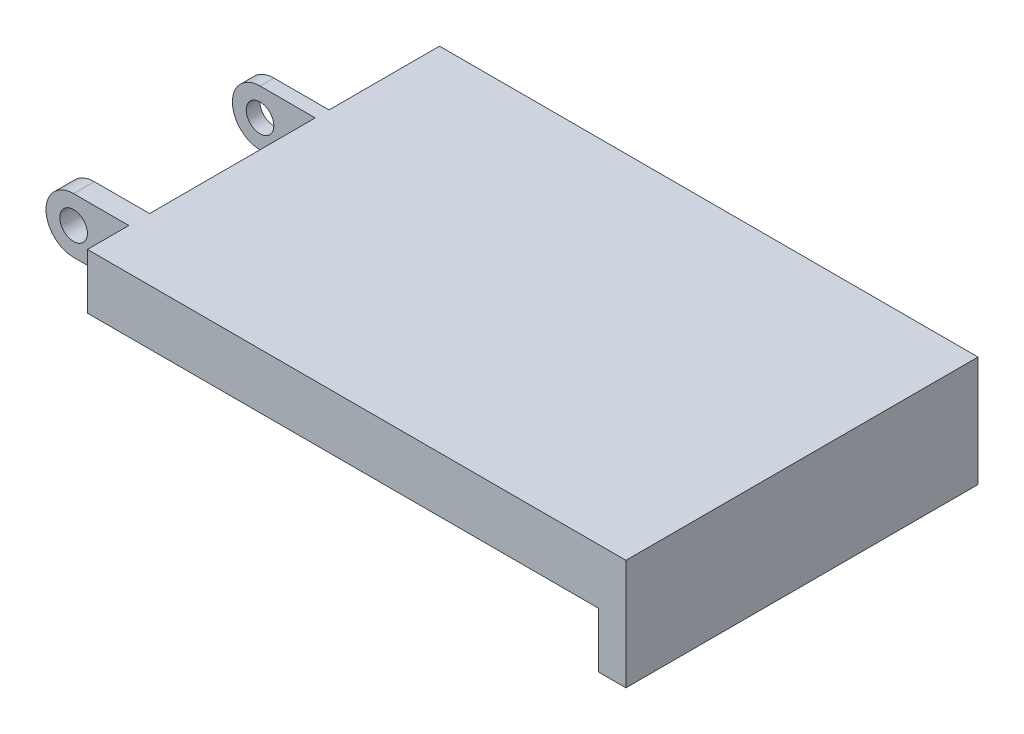
ISO-10303-21;
HEADER;
FILE_DESCRIPTION(('STEP AP214'),'2;1');
FILE_NAME('part.step','',(''),(''),'','','');
FILE_SCHEMA(('AUTOMOTIVE_DESIGN { 1 0 10303 214 1 1 1 1 }'));
ENDSEC;
DATA;
#1=APPLICATION_CONTEXT('core data for automotive mechanical design processes');
#2=APPLICATION_PROTOCOL_DEFINITION('international standard','automotive_design',2000,#1);
#3=PRODUCT_CONTEXT('',#1,'mechanical');
#4=PRODUCT('Part','Part','',(#3));
#5=PRODUCT_RELATED_PRODUCT_CATEGORY('part','',(#4));
#6=PRODUCT_DEFINITION_FORMATION('','',#4);
#7=PRODUCT_DEFINITION_CONTEXT('part definition',#1,'design');
#8=PRODUCT_DEFINITION('design','',#6,#7);
#9=PRODUCT_DEFINITION_SHAPE('','',#8);
#10=(LENGTH_UNIT() NAMED_UNIT(*) SI_UNIT(.MILLI.,.METRE.));
#11=(NAMED_UNIT(*) PLANE_ANGLE_UNIT() SI_UNIT($,.RADIAN.));
#12=(NAMED_UNIT(*) SI_UNIT($,.STERADIAN.) SOLID_ANGLE_UNIT());
#13=UNCERTAINTY_MEASURE_WITH_UNIT(LENGTH_MEASURE(1.E-05),#10,'distance_accuracy_value','');
#14=(GEOMETRIC_REPRESENTATION_CONTEXT(3) GLOBAL_UNCERTAINTY_ASSIGNED_CONTEXT((#13)) GLOBAL_UNIT_ASSIGNED_CONTEXT((#10,
#11,#12)) REPRESENTATION_CONTEXT('',''));
#15=CARTESIAN_POINT('',(0.,0.,0.));
#16=DIRECTION('',(0.,0.,1.));
#17=DIRECTION('',(1.,0.,0.));
#18=AXIS2_PLACEMENT_3D('',#15,#16,#17);
#19=CARTESIAN_POINT('',(41.,-5.99999999999999,25.5));
#20=DIRECTION('',(1.,0.,0.));
#21=DIRECTION('',(0.,0.,-1.));
#22=AXIS2_PLACEMENT_3D('',#19,#20,#21);
#23=PLANE('',#22);
#24=DIRECTION('',(0.,1.,0.));
#25=VECTOR('',#24,1.);
#26=CARTESIAN_POINT('',(41.,-6.,13.75));
#27=LINE('',#26,#25);
#28=CARTESIAN_POINT('',(41.,-6.,13.75));
#29=VERTEX_POINT('',#28);
#30=CARTESIAN_POINT('',(41.,-5.06840956055413,13.75));
#31=VERTEX_POINT('',#30);
#32=EDGE_CURVE('E189',#29,#31,#27,.T.);
#33=ORIENTED_EDGE('',*,*,#32,.F.);
#34=DIRECTION('',(0.,0.,-1.));
#35=VECTOR('',#34,1.);
#36=CARTESIAN_POINT('',(41.,-5.99999999999999,25.5));
#37=LINE('',#36,#35);
#38=CARTESIAN_POINT('',(41.,-5.99999999999999,25.5));
#39=VERTEX_POINT('',#38);
#40=EDGE_CURVE('E175',#39,#29,#37,.T.);
#41=ORIENTED_EDGE('',*,*,#40,.F.);
#42=DIRECTION('',(0.,-1.,0.));
#43=VECTOR('',#42,1.);
#44=CARTESIAN_POINT('',(41.,-5.99999999999999,25.5));
#45=LINE('',#44,#43);
#46=CARTESIAN_POINT('',(41.,-2.,25.5));
#47=VERTEX_POINT('',#46);
#48=EDGE_CURVE('E269',#47,#39,#45,.T.);
#49=ORIENTED_EDGE('',*,*,#48,.F.);
#50=DIRECTION('',(0.,0.,-1.));
#51=VECTOR('',#50,1.);
#52=CARTESIAN_POINT('',(41.,-2.,25.5));
#53=LINE('',#52,#51);
#54=CARTESIAN_POINT('',(41.,-2.,0.));
#55=VERTEX_POINT('',#54);
#56=EDGE_CURVE('E301',#47,#55,#53,.T.);
#57=ORIENTED_EDGE('',*,*,#56,.T.);
#58=DIRECTION('',(0.,-1.,0.));
#59=VECTOR('',#58,1.);
#60=CARTESIAN_POINT('',(41.,-5.99999999999999,0.));
#61=LINE('',#60,#59);
#62=CARTESIAN_POINT('',(41.,-5.99999999999999,0.));
#63=VERTEX_POINT('',#62);
#64=EDGE_CURVE('E281',#55,#63,#61,.T.);
#65=ORIENTED_EDGE('',*,*,#64,.T.);
#66=CARTESIAN_POINT('',(41.,-5.99999999999999,11.75));
#67=VERTEX_POINT('',#66);
#68=EDGE_CURVE('E299',#67,#63,#37,.T.);
#69=ORIENTED_EDGE('',*,*,#68,.F.);
#70=DIRECTION('',(0.,-1.,0.));
#71=VECTOR('',#70,1.);
#72=CARTESIAN_POINT('',(41.,-5.06840956055413,11.75));
#73=LINE('',#72,#71);
#74=CARTESIAN_POINT('',(41.,-5.06840956055413,11.75));
#75=VERTEX_POINT('',#74);
#76=EDGE_CURVE('E168',#75,#67,#73,.T.);
#77=ORIENTED_EDGE('',*,*,#76,.F.);
#78=DIRECTION('',(0.,0.,-1.));
#79=VECTOR('',#78,1.);
#80=CARTESIAN_POINT('',(41.,-5.06840956055413,13.75));
#81=LINE('',#80,#79);
#82=EDGE_CURVE('E191',#31,#75,#81,.T.);
#83=ORIENTED_EDGE('',*,*,#82,.F.);
#84=EDGE_LOOP('',(#33,#41,#49,#57,#65,#69,#77,#83));
#85=FACE_BOUND('',#84,.T.);
#86=ADVANCED_FACE('F35',(#85),#23,.F.);
#87=CARTESIAN_POINT('',(0.,0.,25.5));
#88=DIRECTION('',(0.,0.,-1.));
#89=DIRECTION('',(-1.,0.,0.));
#90=AXIS2_PLACEMENT_3D('',#87,#88,#89);
#91=CYLINDRICAL_SURFACE('',#90,2.);
#92=CARTESIAN_POINT('',(0.,0.,21.));
#93=DIRECTION('',(0.,0.,-1.));
#94=DIRECTION('',(-1.,0.,0.));
#95=AXIS2_PLACEMENT_3D('',#92,#93,#94);
#96=CIRCLE('',#95,2.);
#97=CARTESIAN_POINT('',(0.,-2.,21.));
#98=VERTEX_POINT('',#97);
#99=CARTESIAN_POINT('',(0.,2.,21.));
#100=VERTEX_POINT('',#99);
#101=EDGE_CURVE('E199',#98,#100,#96,.T.);
#102=ORIENTED_EDGE('',*,*,#101,.F.);
#103=DIRECTION('',(0.,0.,-1.));
#104=VECTOR('',#103,1.);
#105=CARTESIAN_POINT('',(0.,-2.,25.5));
#106=LINE('',#105,#104);
#107=CARTESIAN_POINT('',(0.,-2.,22.5));
#108=VERTEX_POINT('',#107);
#109=EDGE_CURVE('E11',#108,#98,#106,.T.);
#110=ORIENTED_EDGE('',*,*,#109,.F.);
#111=CARTESIAN_POINT('',(0.,0.,22.5));
#112=DIRECTION('',(0.,0.,1.));
#113=DIRECTION('',(1.,0.,0.));
#114=AXIS2_PLACEMENT_3D('',#111,#112,#113);
#115=CIRCLE('',#114,2.);
#116=CARTESIAN_POINT('',(0.,2.,22.5));
#117=VERTEX_POINT('',#116);
#118=EDGE_CURVE('E264',#117,#108,#115,.T.);
#119=ORIENTED_EDGE('',*,*,#118,.F.);
#120=DIRECTION('',(0.,0.,-1.));
#121=VECTOR('',#120,1.);
#122=CARTESIAN_POINT('',(0.,2.,25.5));
#123=LINE('',#122,#121);
#124=EDGE_CURVE('E290',#117,#100,#123,.T.);
#125=ORIENTED_EDGE('',*,*,#124,.T.);
#126=EDGE_LOOP('',(#102,#110,#119,#125));
#127=FACE_BOUND('',#126,.T.);
#128=ADVANCED_FACE('F352',(#127),#91,.T.);
#129=CARTESIAN_POINT('',(0.,0.,25.5));
#130=DIRECTION('',(0.,0.,-1.));
#131=DIRECTION('',(-1.,0.,0.));
#132=AXIS2_PLACEMENT_3D('',#129,#130,#131);
#133=CYLINDRICAL_SURFACE('',#132,1.);
#134=CARTESIAN_POINT('',(0.,0.,22.5));
#135=DIRECTION('',(0.,0.,1.));
#136=DIRECTION('',(1.,0.,0.));
#137=AXIS2_PLACEMENT_3D('',#134,#135,#136);
#138=CIRCLE('',#137,1.);
#139=CARTESIAN_POINT('',(1.,0.,22.5));
#140=VERTEX_POINT('',#139);
#141=EDGE_CURVE('E39',#140,#140,#138,.T.);
#142=ORIENTED_EDGE('',*,*,#141,.T.);
#143=EDGE_LOOP('',(#142));
#144=FACE_BOUND('',#143,.T.);
#145=CARTESIAN_POINT('',(0.,0.,21.));
#146=DIRECTION('',(0.,0.,-1.));
#147=DIRECTION('',(-1.,0.,0.));
#148=AXIS2_PLACEMENT_3D('',#145,#146,#147);
#149=CIRCLE('',#148,1.);
#150=CARTESIAN_POINT('',(-1.,0.,21.));
#151=VERTEX_POINT('',#150);
#152=EDGE_CURVE('E226',#151,#151,#149,.T.);
#153=ORIENTED_EDGE('',*,*,#152,.T.);
#154=EDGE_LOOP('',(#153));
#155=FACE_BOUND('',#154,.T.);
#156=ADVANCED_FACE('F375',(#144,#155),#133,.F.);
#157=CARTESIAN_POINT('',(41.,-2.,25.5));
#158=DIRECTION('',(0.,1.,0.));
#159=DIRECTION('',(-1.,0.,0.));
#160=AXIS2_PLACEMENT_3D('',#157,#158,#159);
#161=PLANE('',#160);
#162=DIRECTION('',(-1.,0.,0.));
#163=VECTOR('',#162,1.);
#164=CARTESIAN_POINT('',(4.,-2.,21.));
#165=LINE('',#164,#163);
#166=CARTESIAN_POINT('',(4.,-2.,21.));
#167=VERTEX_POINT('',#166);
#168=EDGE_CURVE('E208',#167,#98,#165,.T.);
#169=ORIENTED_EDGE('',*,*,#168,.F.);
#170=DIRECTION('',(0.,0.,-1.));
#171=VECTOR('',#170,1.);
#172=CARTESIAN_POINT('',(4.,-2.,21.));
#173=LINE('',#172,#171);
#174=CARTESIAN_POINT('',(4.,-2.,9.));
#175=VERTEX_POINT('',#174);
#176=EDGE_CURVE('E219',#167,#175,#173,.T.);
#177=ORIENTED_EDGE('',*,*,#176,.T.);
#178=DIRECTION('',(-1.,0.,0.));
#179=VECTOR('',#178,1.);
#180=CARTESIAN_POINT('',(4.,-2.,9.));
#181=LINE('',#180,#179);
#182=CARTESIAN_POINT('',(0.,-2.,9.));
#183=VERTEX_POINT('',#182);
#184=EDGE_CURVE('E202',#175,#183,#181,.T.);
#185=ORIENTED_EDGE('',*,*,#184,.T.);
#186=CARTESIAN_POINT('',(0.,-2.,8.));
#187=VERTEX_POINT('',#186);
#188=EDGE_CURVE('E44',#183,#187,#106,.T.);
#189=ORIENTED_EDGE('',*,*,#188,.T.);
#190=DIRECTION('',(-1.,0.,0.));
#191=VECTOR('',#190,1.);
#192=CARTESIAN_POINT('',(4.,-2.,8.));
#193=LINE('',#192,#191);
#194=CARTESIAN_POINT('',(4.,-2.,8.));
#195=VERTEX_POINT('',#194);
#196=EDGE_CURVE('E239',#195,#187,#193,.T.);
#197=ORIENTED_EDGE('',*,*,#196,.F.);
#198=DIRECTION('',(0.,0.,-1.));
#199=VECTOR('',#198,1.);
#200=CARTESIAN_POINT('',(4.,-2.,8.));
#201=LINE('',#200,#199);
#202=CARTESIAN_POINT('',(4.,-2.,0.));
#203=VERTEX_POINT('',#202);
#204=EDGE_CURVE('E244',#195,#203,#201,.T.);
#205=ORIENTED_EDGE('',*,*,#204,.T.);
#206=DIRECTION('',(1.,0.,0.));
#207=VECTOR('',#206,1.);
#208=CARTESIAN_POINT('',(41.,-2.,0.));
#209=LINE('',#208,#207);
#210=EDGE_CURVE('E266',#203,#55,#209,.T.);
#211=ORIENTED_EDGE('',*,*,#210,.T.);
#212=ORIENTED_EDGE('',*,*,#56,.F.);
#213=DIRECTION('',(1.,0.,0.));
#214=VECTOR('',#213,1.);
#215=CARTESIAN_POINT('',(41.,-2.,25.5));
#216=LINE('',#215,#214);
#217=CARTESIAN_POINT('',(4.,-2.,25.5));
#218=VERTEX_POINT('',#217);
#219=EDGE_CURVE('E267',#218,#47,#216,.T.);
#220=ORIENTED_EDGE('',*,*,#219,.F.);
#221=DIRECTION('',(0.,0.,1.));
#222=VECTOR('',#221,1.);
#223=CARTESIAN_POINT('',(4.,-2.,22.5));
#224=LINE('',#223,#222);
#225=CARTESIAN_POINT('',(4.,-2.,22.5));
#226=VERTEX_POINT('',#225);
#227=EDGE_CURVE('E258',#226,#218,#224,.T.);
#228=ORIENTED_EDGE('',*,*,#227,.F.);
#229=DIRECTION('',(1.,0.,0.));
#230=VECTOR('',#229,1.);
#231=CARTESIAN_POINT('',(-4.,-2.,22.5));
#232=LINE('',#231,#230);
#233=EDGE_CURVE('E252',#108,#226,#232,.T.);
#234=ORIENTED_EDGE('',*,*,#233,.F.);
#235=ORIENTED_EDGE('',*,*,#109,.T.);
#236=EDGE_LOOP('',(#169,#177,#185,#189,#197,#205,#211,#212,#220,#228,#234,#235));
#237=FACE_BOUND('',#236,.T.);
#238=ADVANCED_FACE('F311',(#237),#161,.F.);
#239=CARTESIAN_POINT('',(0.,2.,25.5));
#240=DIRECTION('',(0.,-1.,0.));
#241=DIRECTION('',(1.,0.,0.));
#242=AXIS2_PLACEMENT_3D('',#239,#240,#241);
#243=PLANE('',#242);
#244=DIRECTION('',(1.,0.,0.));
#245=VECTOR('',#244,1.);
#246=CARTESIAN_POINT('',(0.,2.,21.));
#247=LINE('',#246,#245);
#248=CARTESIAN_POINT('',(4.,2.,21.));
#249=VERTEX_POINT('',#248);
#250=EDGE_CURVE('E201',#100,#249,#247,.T.);
#251=ORIENTED_EDGE('',*,*,#250,.F.);
#252=ORIENTED_EDGE('',*,*,#124,.F.);
#253=DIRECTION('',(-1.,0.,0.));
#254=VECTOR('',#253,1.);
#255=CARTESIAN_POINT('',(4.,2.,22.5));
#256=LINE('',#255,#254);
#257=CARTESIAN_POINT('',(4.,2.,22.5));
#258=VERTEX_POINT('',#257);
#259=EDGE_CURVE('E256',#258,#117,#256,.T.);
#260=ORIENTED_EDGE('',*,*,#259,.F.);
#261=DIRECTION('',(0.,0.,1.));
#262=VECTOR('',#261,1.);
#263=CARTESIAN_POINT('',(4.,2.,22.5));
#264=LINE('',#263,#262);
#265=CARTESIAN_POINT('',(4.,2.,25.5));
#266=VERTEX_POINT('',#265);
#267=EDGE_CURVE('E260',#258,#266,#264,.T.);
#268=ORIENTED_EDGE('',*,*,#267,.T.);
#269=DIRECTION('',(-1.,0.,0.));
#270=VECTOR('',#269,1.);
#271=CARTESIAN_POINT('',(0.,2.,25.5));
#272=LINE('',#271,#270);
#273=CARTESIAN_POINT('',(43.,1.99999999999999,25.5));
#274=VERTEX_POINT('',#273);
#275=EDGE_CURVE('E276',#274,#266,#272,.T.);
#276=ORIENTED_EDGE('',*,*,#275,.F.);
#277=DIRECTION('',(0.,0.,-1.));
#278=VECTOR('',#277,1.);
#279=CARTESIAN_POINT('',(43.,1.99999999999999,25.5));
#280=LINE('',#279,#278);
#281=CARTESIAN_POINT('',(43.,1.99999999999999,0.));
#282=VERTEX_POINT('',#281);
#283=EDGE_CURVE('E293',#274,#282,#280,.T.);
#284=ORIENTED_EDGE('',*,*,#283,.T.);
#285=DIRECTION('',(-1.,0.,0.));
#286=VECTOR('',#285,1.);
#287=CARTESIAN_POINT('',(0.,2.,0.));
#288=LINE('',#287,#286);
#289=CARTESIAN_POINT('',(4.,2.,0.));
#290=VERTEX_POINT('',#289);
#291=EDGE_CURVE('E270',#282,#290,#288,.T.);
#292=ORIENTED_EDGE('',*,*,#291,.T.);
#293=DIRECTION('',(0.,0.,-1.));
#294=VECTOR('',#293,1.);
#295=CARTESIAN_POINT('',(4.,2.,8.));
#296=LINE('',#295,#294);
#297=CARTESIAN_POINT('',(4.,2.,8.));
#298=VERTEX_POINT('',#297);
#299=EDGE_CURVE('E242',#298,#290,#296,.T.);
#300=ORIENTED_EDGE('',*,*,#299,.F.);
#301=DIRECTION('',(1.,0.,0.));
#302=VECTOR('',#301,1.);
#303=CARTESIAN_POINT('',(0.,2.,8.));
#304=LINE('',#303,#302);
#305=CARTESIAN_POINT('',(0.,2.,8.));
#306=VERTEX_POINT('',#305);
#307=EDGE_CURVE('E233',#306,#298,#304,.T.);
#308=ORIENTED_EDGE('',*,*,#307,.F.);
#309=CARTESIAN_POINT('',(0.,2.,9.));
#310=VERTEX_POINT('',#309);
#311=EDGE_CURVE('E279',#310,#306,#123,.T.);
#312=ORIENTED_EDGE('',*,*,#311,.F.);
#313=DIRECTION('',(1.,0.,0.));
#314=VECTOR('',#313,1.);
#315=CARTESIAN_POINT('',(0.,2.,9.));
#316=LINE('',#315,#314);
#317=CARTESIAN_POINT('',(4.,2.,9.));
#318=VERTEX_POINT('',#317);
#319=EDGE_CURVE('E213',#310,#318,#316,.T.);
#320=ORIENTED_EDGE('',*,*,#319,.T.);
#321=DIRECTION('',(0.,0.,-1.));
#322=VECTOR('',#321,1.);
#323=CARTESIAN_POINT('',(4.,2.,21.));
#324=LINE('',#323,#322);
#325=EDGE_CURVE('E210',#249,#318,#324,.T.);
#326=ORIENTED_EDGE('',*,*,#325,.F.);
#327=EDGE_LOOP('',(#251,#252,#260,#268,#276,#284,#292,#300,#308,#312,#320,#326));
#328=FACE_BOUND('',#327,.T.);
#329=ADVANCED_FACE('F320',(#328),#243,.F.);
#330=ORIENTED_EDGE('',*,*,#188,.F.);
#331=CARTESIAN_POINT('',(0.,0.,9.));
#332=DIRECTION('',(0.,0.,-1.));
#333=DIRECTION('',(-1.,0.,0.));
#334=AXIS2_PLACEMENT_3D('',#331,#332,#333);
#335=CIRCLE('',#334,2.);
#336=EDGE_CURVE('E178',#183,#310,#335,.T.);
#337=ORIENTED_EDGE('',*,*,#336,.T.);
#338=ORIENTED_EDGE('',*,*,#311,.T.);
#339=CARTESIAN_POINT('',(0.,0.,8.));
#340=DIRECTION('',(0.,0.,-1.));
#341=DIRECTION('',(-1.,0.,0.));
#342=AXIS2_PLACEMENT_3D('',#339,#340,#341);
#343=CIRCLE('',#342,2.);
#344=EDGE_CURVE('E230',#187,#306,#343,.T.);
#345=ORIENTED_EDGE('',*,*,#344,.F.);
#346=EDGE_LOOP('',(#330,#337,#338,#345));
#347=FACE_BOUND('',#346,.T.);
#348=ADVANCED_FACE('F37',(#347),#91,.T.);
#349=CARTESIAN_POINT('',(0.,0.,9.));
#350=DIRECTION('',(0.,0.,-1.));
#351=DIRECTION('',(-1.,0.,0.));
#352=AXIS2_PLACEMENT_3D('',#349,#350,#351);
#353=CIRCLE('',#352,1.);
#354=CARTESIAN_POINT('',(-1.,0.,9.));
#355=VERTEX_POINT('',#354);
#356=EDGE_CURVE('E222',#355,#355,#353,.T.);
#357=ORIENTED_EDGE('',*,*,#356,.F.);
#358=EDGE_LOOP('',(#357));
#359=FACE_BOUND('',#358,.T.);
#360=CARTESIAN_POINT('',(0.,0.,8.));
#361=DIRECTION('',(0.,0.,-1.));
#362=DIRECTION('',(-1.,0.,0.));
#363=AXIS2_PLACEMENT_3D('',#360,#361,#362);
#364=CIRCLE('',#363,1.);
#365=CARTESIAN_POINT('',(-1.,0.,8.));
#366=VERTEX_POINT('',#365);
#367=EDGE_CURVE('E247',#366,#366,#364,.T.);
#368=ORIENTED_EDGE('',*,*,#367,.T.);
#369=EDGE_LOOP('',(#368));
#370=FACE_BOUND('',#369,.T.);
#371=ADVANCED_FACE('F386',(#359,#370),#133,.F.);
#372=CARTESIAN_POINT('',(0.,0.,25.5));
#373=DIRECTION('',(0.,0.,1.));
#374=DIRECTION('',(1.,0.,0.));
#375=AXIS2_PLACEMENT_3D('',#372,#373,#374);
#376=PLANE('',#375);
#377=DIRECTION('',(0.,1.,0.));
#378=VECTOR('',#377,1.);
#379=CARTESIAN_POINT('',(4.,-2.,25.5));
#380=LINE('',#379,#378);
#381=EDGE_CURVE('E251',#218,#266,#380,.T.);
#382=ORIENTED_EDGE('',*,*,#381,.F.);
#383=ORIENTED_EDGE('',*,*,#219,.T.);
#384=ORIENTED_EDGE('',*,*,#48,.T.);
#385=DIRECTION('',(1.,0.,0.));
#386=VECTOR('',#385,1.);
#387=CARTESIAN_POINT('',(43.,-5.99999999999999,25.5));
#388=LINE('',#387,#386);
#389=CARTESIAN_POINT('',(43.,-5.99999999999999,25.5));
#390=VERTEX_POINT('',#389);
#391=EDGE_CURVE('E272',#39,#390,#388,.T.);
#392=ORIENTED_EDGE('',*,*,#391,.T.);
#393=DIRECTION('',(0.,1.,0.));
#394=VECTOR('',#393,1.);
#395=CARTESIAN_POINT('',(43.,1.99999999999999,25.5));
#396=LINE('',#395,#394);
#397=EDGE_CURVE('E274',#390,#274,#396,.T.);
#398=ORIENTED_EDGE('',*,*,#397,.T.);
#399=ORIENTED_EDGE('',*,*,#275,.T.);
#400=EDGE_LOOP('',(#382,#383,#384,#392,#398,#399));
#401=FACE_BOUND('',#400,.T.);
#402=ADVANCED_FACE('F336',(#401),#376,.T.);
#403=CARTESIAN_POINT('',(0.,0.,0.));
#404=DIRECTION('',(0.,0.,1.));
#405=DIRECTION('',(1.,0.,0.));
#406=AXIS2_PLACEMENT_3D('',#403,#404,#405);
#407=PLANE('',#406);
#408=ORIENTED_EDGE('',*,*,#210,.F.);
#409=DIRECTION('',(0.,-1.,0.));
#410=VECTOR('',#409,1.);
#411=CARTESIAN_POINT('',(4.,2.,0.));
#412=LINE('',#411,#410);
#413=EDGE_CURVE('E229',#290,#203,#412,.T.);
#414=ORIENTED_EDGE('',*,*,#413,.F.);
#415=ORIENTED_EDGE('',*,*,#291,.F.);
#416=DIRECTION('',(0.,1.,0.));
#417=VECTOR('',#416,1.);
#418=CARTESIAN_POINT('',(43.,1.99999999999999,0.));
#419=LINE('',#418,#417);
#420=CARTESIAN_POINT('',(43.,-5.99999999999999,0.));
#421=VERTEX_POINT('',#420);
#422=EDGE_CURVE('E286',#421,#282,#419,.T.);
#423=ORIENTED_EDGE('',*,*,#422,.F.);
#424=DIRECTION('',(1.,0.,0.));
#425=VECTOR('',#424,1.);
#426=CARTESIAN_POINT('',(43.,-5.99999999999999,0.));
#427=LINE('',#426,#425);
#428=EDGE_CURVE('E284',#63,#421,#427,.T.);
#429=ORIENTED_EDGE('',*,*,#428,.F.);
#430=ORIENTED_EDGE('',*,*,#64,.F.);
#431=EDGE_LOOP('',(#408,#414,#415,#423,#429,#430));
#432=FACE_BOUND('',#431,.T.);
#433=ADVANCED_FACE('F329',(#432),#407,.F.);
#434=CARTESIAN_POINT('',(43.,-5.99999999999999,25.5));
#435=DIRECTION('',(0.,1.,0.));
#436=DIRECTION('',(0.,0.,1.));
#437=AXIS2_PLACEMENT_3D('',#434,#435,#436);
#438=PLANE('',#437);
#439=ORIENTED_EDGE('',*,*,#428,.T.);
#440=DIRECTION('',(0.,0.,-1.));
#441=VECTOR('',#440,1.);
#442=CARTESIAN_POINT('',(43.,-5.99999999999999,25.5));
#443=LINE('',#442,#441);
#444=EDGE_CURVE('E296',#390,#421,#443,.T.);
#445=ORIENTED_EDGE('',*,*,#444,.F.);
#446=ORIENTED_EDGE('',*,*,#391,.F.);
#447=ORIENTED_EDGE('',*,*,#40,.T.);
#448=DIRECTION('',(1.,0.,0.));
#449=VECTOR('',#448,1.);
#450=CARTESIAN_POINT('',(40.5,-6.,13.75));
#451=LINE('',#450,#449);
#452=CARTESIAN_POINT('',(40.5,-6.,13.75));
#453=VERTEX_POINT('',#452);
#454=EDGE_CURVE('E171',#453,#29,#451,.T.);
#455=ORIENTED_EDGE('',*,*,#454,.F.);
#456=DIRECTION('',(0.,0.,1.));
#457=VECTOR('',#456,1.);
#458=CARTESIAN_POINT('',(40.5,-5.99999999999999,11.75));
#459=LINE('',#458,#457);
#460=CARTESIAN_POINT('',(40.5,-5.99999999999999,11.75));
#461=VERTEX_POINT('',#460);
#462=EDGE_CURVE('E160',#461,#453,#459,.T.);
#463=ORIENTED_EDGE('',*,*,#462,.F.);
#464=DIRECTION('',(1.,0.,0.));
#465=VECTOR('',#464,1.);
#466=CARTESIAN_POINT('',(40.5,-5.99999999999999,11.75));
#467=LINE('',#466,#465);
#468=EDGE_CURVE('E51',#461,#67,#467,.T.);
#469=ORIENTED_EDGE('',*,*,#468,.T.);
#470=ORIENTED_EDGE('',*,*,#68,.T.);
#471=EDGE_LOOP('',(#439,#445,#446,#447,#455,#463,#469,#470));
#472=FACE_BOUND('',#471,.T.);
#473=ADVANCED_FACE('F172',(#472),#438,.F.);
#474=CARTESIAN_POINT('',(43.,1.99999999999999,25.5));
#475=DIRECTION('',(-1.,0.,0.));
#476=DIRECTION('',(0.,0.,1.));
#477=AXIS2_PLACEMENT_3D('',#474,#475,#476);
#478=PLANE('',#477);
#479=ORIENTED_EDGE('',*,*,#422,.T.);
#480=ORIENTED_EDGE('',*,*,#283,.F.);
#481=ORIENTED_EDGE('',*,*,#397,.F.);
#482=ORIENTED_EDGE('',*,*,#444,.T.);
#483=EDGE_LOOP('',(#479,#480,#481,#482));
#484=FACE_BOUND('',#483,.T.);
#485=ADVANCED_FACE('F412',(#484),#478,.F.);
#486=CARTESIAN_POINT('',(0.,0.,22.5));
#487=DIRECTION('',(0.,0.,1.));
#488=DIRECTION('',(1.,0.,0.));
#489=AXIS2_PLACEMENT_3D('',#486,#487,#488);
#490=PLANE('',#489);
#491=ORIENTED_EDGE('',*,*,#141,.F.);
#492=EDGE_LOOP('',(#491));
#493=FACE_BOUND('',#492,.T.);
#494=ORIENTED_EDGE('',*,*,#118,.T.);
#495=ORIENTED_EDGE('',*,*,#233,.T.);
#496=DIRECTION('',(0.,1.,0.));
#497=VECTOR('',#496,1.);
#498=CARTESIAN_POINT('',(4.,-2.,22.5));
#499=LINE('',#498,#497);
#500=EDGE_CURVE('E254',#226,#258,#499,.T.);
#501=ORIENTED_EDGE('',*,*,#500,.T.);
#502=ORIENTED_EDGE('',*,*,#259,.T.);
#503=EDGE_LOOP('',(#494,#495,#501,#502));
#504=FACE_BOUND('',#503,.T.);
#505=ADVANCED_FACE('F347',(#493,#504),#490,.T.);
#506=CARTESIAN_POINT('',(4.,-2.,22.5));
#507=DIRECTION('',(1.,0.,0.));
#508=DIRECTION('',(0.,1.,0.));
#509=AXIS2_PLACEMENT_3D('',#506,#507,#508);
#510=PLANE('',#509);
#511=ORIENTED_EDGE('',*,*,#381,.T.);
#512=ORIENTED_EDGE('',*,*,#267,.F.);
#513=ORIENTED_EDGE('',*,*,#500,.F.);
#514=ORIENTED_EDGE('',*,*,#227,.T.);
#515=EDGE_LOOP('',(#511,#512,#513,#514));
#516=FACE_BOUND('',#515,.T.);
#517=ADVANCED_FACE('F341',(#516),#510,.F.);
#518=CARTESIAN_POINT('',(4.,2.,8.));
#519=DIRECTION('',(1.,0.,0.));
#520=DIRECTION('',(0.,1.,0.));
#521=AXIS2_PLACEMENT_3D('',#518,#519,#520);
#522=PLANE('',#521);
#523=ORIENTED_EDGE('',*,*,#413,.T.);
#524=ORIENTED_EDGE('',*,*,#204,.F.);
#525=DIRECTION('',(0.,-1.,0.));
#526=VECTOR('',#525,1.);
#527=CARTESIAN_POINT('',(4.,2.,8.));
#528=LINE('',#527,#526);
#529=EDGE_CURVE('E236',#298,#195,#528,.T.);
#530=ORIENTED_EDGE('',*,*,#529,.F.);
#531=ORIENTED_EDGE('',*,*,#299,.T.);
#532=EDGE_LOOP('',(#523,#524,#530,#531));
#533=FACE_BOUND('',#532,.T.);
#534=ADVANCED_FACE('F326',(#533),#522,.F.);
#535=CARTESIAN_POINT('',(0.,0.,8.));
#536=DIRECTION('',(0.,0.,-1.));
#537=DIRECTION('',(-1.,0.,0.));
#538=AXIS2_PLACEMENT_3D('',#535,#536,#537);
#539=PLANE('',#538);
#540=ORIENTED_EDGE('',*,*,#367,.F.);
#541=EDGE_LOOP('',(#540));
#542=FACE_BOUND('',#541,.T.);
#543=ORIENTED_EDGE('',*,*,#344,.T.);
#544=ORIENTED_EDGE('',*,*,#307,.T.);
#545=ORIENTED_EDGE('',*,*,#529,.T.);
#546=ORIENTED_EDGE('',*,*,#196,.T.);
#547=EDGE_LOOP('',(#543,#544,#545,#546));
#548=FACE_BOUND('',#547,.T.);
#549=ADVANCED_FACE('F315',(#542,#548),#539,.T.);
#550=CARTESIAN_POINT('',(4.,2.,21.));
#551=DIRECTION('',(1.,0.,0.));
#552=DIRECTION('',(0.,1.,0.));
#553=AXIS2_PLACEMENT_3D('',#550,#551,#552);
#554=PLANE('',#553);
#555=DIRECTION('',(0.,-1.,0.));
#556=VECTOR('',#555,1.);
#557=CARTESIAN_POINT('',(4.,2.,9.));
#558=LINE('',#557,#556);
#559=EDGE_CURVE('E59',#318,#175,#558,.T.);
#560=ORIENTED_EDGE('',*,*,#559,.T.);
#561=ORIENTED_EDGE('',*,*,#176,.F.);
#562=DIRECTION('',(0.,-1.,0.));
#563=VECTOR('',#562,1.);
#564=CARTESIAN_POINT('',(4.,2.,21.));
#565=LINE('',#564,#563);
#566=EDGE_CURVE('E205',#249,#167,#565,.T.);
#567=ORIENTED_EDGE('',*,*,#566,.F.);
#568=ORIENTED_EDGE('',*,*,#325,.T.);
#569=EDGE_LOOP('',(#560,#561,#567,#568));
#570=FACE_BOUND('',#569,.T.);
#571=ADVANCED_FACE('F356',(#570),#554,.F.);
#572=CARTESIAN_POINT('',(0.,0.,21.));
#573=DIRECTION('',(0.,0.,-1.));
#574=DIRECTION('',(-1.,0.,0.));
#575=AXIS2_PLACEMENT_3D('',#572,#573,#574);
#576=PLANE('',#575);
#577=ORIENTED_EDGE('',*,*,#152,.F.);
#578=EDGE_LOOP('',(#577));
#579=FACE_BOUND('',#578,.T.);
#580=ORIENTED_EDGE('',*,*,#101,.T.);
#581=ORIENTED_EDGE('',*,*,#250,.T.);
#582=ORIENTED_EDGE('',*,*,#566,.T.);
#583=ORIENTED_EDGE('',*,*,#168,.T.);
#584=EDGE_LOOP('',(#580,#581,#582,#583));
#585=FACE_BOUND('',#584,.T.);
#586=ADVANCED_FACE('F354',(#579,#585),#576,.T.);
#587=CARTESIAN_POINT('',(0.,0.,9.));
#588=DIRECTION('',(0.,0.,-1.));
#589=DIRECTION('',(-1.,0.,0.));
#590=AXIS2_PLACEMENT_3D('',#587,#588,#589);
#591=PLANE('',#590);
#592=ORIENTED_EDGE('',*,*,#356,.T.);
#593=EDGE_LOOP('',(#592));
#594=FACE_BOUND('',#593,.T.);
#595=ORIENTED_EDGE('',*,*,#336,.F.);
#596=ORIENTED_EDGE('',*,*,#184,.F.);
#597=ORIENTED_EDGE('',*,*,#559,.F.);
#598=ORIENTED_EDGE('',*,*,#319,.F.);
#599=EDGE_LOOP('',(#595,#596,#597,#598));
#600=FACE_BOUND('',#599,.T.);
#601=ADVANCED_FACE('F357',(#594,#600),#591,.F.);
#602=CARTESIAN_POINT('',(40.5,-6.,13.75));
#603=DIRECTION('',(0.,0.,-1.));
#604=DIRECTION('',(-1.,0.,0.));
#605=AXIS2_PLACEMENT_3D('',#602,#603,#604);
#606=PLANE('',#605);
#607=ORIENTED_EDGE('',*,*,#32,.T.);
#608=DIRECTION('',(1.,0.,0.));
#609=VECTOR('',#608,1.);
#610=CARTESIAN_POINT('',(40.5,-5.06840956055413,13.75));
#611=LINE('',#610,#609);
#612=CARTESIAN_POINT('',(40.5,-5.06840956055413,13.75));
#613=VERTEX_POINT('',#612);
#614=EDGE_CURVE('E179',#613,#31,#611,.T.);
#615=ORIENTED_EDGE('',*,*,#614,.F.);
#616=DIRECTION('',(0.,1.,0.));
#617=VECTOR('',#616,1.);
#618=CARTESIAN_POINT('',(40.5,-6.,13.75));
#619=LINE('',#618,#617);
#620=EDGE_CURVE('E164',#453,#613,#619,.T.);
#621=ORIENTED_EDGE('',*,*,#620,.F.);
#622=ORIENTED_EDGE('',*,*,#454,.T.);
#623=EDGE_LOOP('',(#607,#615,#621,#622));
#624=FACE_BOUND('',#623,.T.);
#625=ADVANCED_FACE('F181',(#624),#606,.F.);
#626=CARTESIAN_POINT('',(40.5,-5.06840956055413,13.75));
#627=DIRECTION('',(0.,-1.,0.));
#628=DIRECTION('',(0.,0.,-1.));
#629=AXIS2_PLACEMENT_3D('',#626,#627,#628);
#630=PLANE('',#629);
#631=ORIENTED_EDGE('',*,*,#82,.T.);
#632=DIRECTION('',(1.,0.,0.));
#633=VECTOR('',#632,1.);
#634=CARTESIAN_POINT('',(40.5,-5.06840956055413,11.75));
#635=LINE('',#634,#633);
#636=CARTESIAN_POINT('',(40.5,-5.06840956055413,11.75));
#637=VERTEX_POINT('',#636);
#638=EDGE_CURVE('E195',#637,#75,#635,.T.);
#639=ORIENTED_EDGE('',*,*,#638,.F.);
#640=DIRECTION('',(0.,0.,-1.));
#641=VECTOR('',#640,1.);
#642=CARTESIAN_POINT('',(40.5,-5.06840956055413,13.75));
#643=LINE('',#642,#641);
#644=EDGE_CURVE('E184',#613,#637,#643,.T.);
#645=ORIENTED_EDGE('',*,*,#644,.F.);
#646=ORIENTED_EDGE('',*,*,#614,.T.);
#647=EDGE_LOOP('',(#631,#639,#645,#646));
#648=FACE_BOUND('',#647,.T.);
#649=ADVANCED_FACE('F365',(#648),#630,.F.);
#650=CARTESIAN_POINT('',(40.5,-5.06840956055413,11.75));
#651=DIRECTION('',(0.,0.,1.));
#652=DIRECTION('',(1.,0.,0.));
#653=AXIS2_PLACEMENT_3D('',#650,#651,#652);
#654=PLANE('',#653);
#655=ORIENTED_EDGE('',*,*,#76,.T.);
#656=ORIENTED_EDGE('',*,*,#468,.F.);
#657=DIRECTION('',(0.,-1.,0.));
#658=VECTOR('',#657,1.);
#659=CARTESIAN_POINT('',(40.5,-5.06840956055413,11.75));
#660=LINE('',#659,#658);
#661=EDGE_CURVE('E167',#637,#461,#660,.T.);
#662=ORIENTED_EDGE('',*,*,#661,.F.);
#663=ORIENTED_EDGE('',*,*,#638,.T.);
#664=EDGE_LOOP('',(#655,#656,#662,#663));
#665=FACE_BOUND('',#664,.T.);
#666=ADVANCED_FACE('F505',(#665),#654,.F.);
#667=CARTESIAN_POINT('',(40.5,0.,0.));
#668=DIRECTION('',(-1.,0.,0.));
#669=DIRECTION('',(0.,0.,1.));
#670=AXIS2_PLACEMENT_3D('',#667,#668,#669);
#671=PLANE('',#670);
#672=ORIENTED_EDGE('',*,*,#462,.T.);
#673=ORIENTED_EDGE('',*,*,#620,.T.);
#674=ORIENTED_EDGE('',*,*,#644,.T.);
#675=ORIENTED_EDGE('',*,*,#661,.T.);
#676=EDGE_LOOP('',(#672,#673,#674,#675));
#677=FACE_BOUND('',#676,.T.);
#678=ADVANCED_FACE('F162',(#677),#671,.T.);
#679=CLOSED_SHELL('',(#86,#128,#156,#238,#329,#348,#371,#402,#433,#473,#485,#505,#517,#534,#549,
#571,#586,#601,#625,#649,#666,#678));
#680=MANIFOLD_SOLID_BREP('B2',#679);
#681=ADVANCED_BREP_SHAPE_REPRESENTATION('',(#18,#680),#14);
#682=SHAPE_DEFINITION_REPRESENTATION(#9,#681);
ENDSEC;
END-ISO-10303-21;
